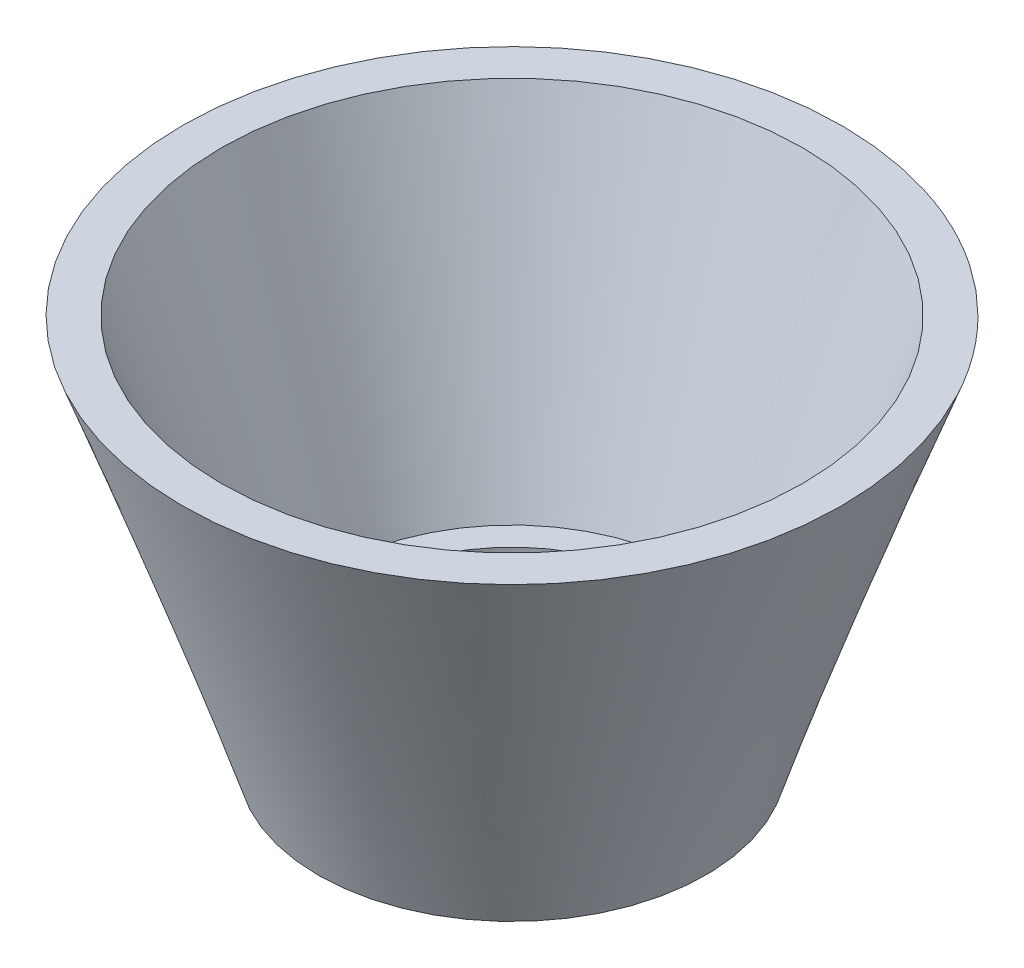
ISO-10303-21;
HEADER;
FILE_DESCRIPTION(('STEP AP214'),'2;1');
FILE_NAME('part.step','',(''),(''),'','','');
FILE_SCHEMA(('AUTOMOTIVE_DESIGN { 1 0 10303 214 1 1 1 1 }'));
ENDSEC;
DATA;
#1=APPLICATION_CONTEXT('core data for automotive mechanical design processes');
#2=APPLICATION_PROTOCOL_DEFINITION('international standard','automotive_design',2000,#1);
#3=PRODUCT_CONTEXT('',#1,'mechanical');
#4=PRODUCT('Part','Part','',(#3));
#5=PRODUCT_RELATED_PRODUCT_CATEGORY('part','',(#4));
#6=PRODUCT_DEFINITION_FORMATION('','',#4);
#7=PRODUCT_DEFINITION_CONTEXT('part definition',#1,'design');
#8=PRODUCT_DEFINITION('design','',#6,#7);
#9=PRODUCT_DEFINITION_SHAPE('','',#8);
#10=(LENGTH_UNIT() NAMED_UNIT(*) SI_UNIT(.MILLI.,.METRE.));
#11=(NAMED_UNIT(*) PLANE_ANGLE_UNIT() SI_UNIT($,.RADIAN.));
#12=(NAMED_UNIT(*) SI_UNIT($,.STERADIAN.) SOLID_ANGLE_UNIT());
#13=UNCERTAINTY_MEASURE_WITH_UNIT(LENGTH_MEASURE(1.E-05),#10,'distance_accuracy_value','');
#14=(GEOMETRIC_REPRESENTATION_CONTEXT(3) GLOBAL_UNCERTAINTY_ASSIGNED_CONTEXT((#13)) GLOBAL_UNIT_ASSIGNED_CONTEXT((#10,
#11,#12)) REPRESENTATION_CONTEXT('',''));
#15=CARTESIAN_POINT('',(0.,0.,0.));
#16=DIRECTION('',(0.,0.,1.));
#17=DIRECTION('',(1.,0.,0.));
#18=AXIS2_PLACEMENT_3D('',#15,#16,#17);
#19=CARTESIAN_POINT('',(0.,0.,0.));
#20=DIRECTION('',(0.,1.,0.));
#21=DIRECTION('',(0.,0.,1.));
#22=AXIS2_PLACEMENT_3D('',#19,#20,#21);
#23=CONICAL_SURFACE('',#22,4.,0.336674819386727);
#24=CARTESIAN_POINT('',(0.,10.,0.));
#25=DIRECTION('',(0.,-1.,0.));
#26=DIRECTION('',(0.,0.,-1.));
#27=AXIS2_PLACEMENT_3D('',#24,#25,#26);
#28=CIRCLE('',#27,7.5);
#29=CARTESIAN_POINT('',(0.,10.,-7.5));
#30=VERTEX_POINT('',#29);
#31=EDGE_CURVE('E51',#30,#30,#28,.T.);
#32=ORIENTED_EDGE('',*,*,#31,.F.);
#33=EDGE_LOOP('',(#32));
#34=FACE_BOUND('',#33,.T.);
#35=CARTESIAN_POINT('',(0.,2.,0.));
#36=DIRECTION('',(0.,-1.,0.));
#37=DIRECTION('',(0.,0.,-1.));
#38=AXIS2_PLACEMENT_3D('',#35,#36,#37);
#39=CIRCLE('',#38,4.7);
#40=CARTESIAN_POINT('',(0.,2.,-4.7));
#41=VERTEX_POINT('',#40);
#42=EDGE_CURVE('E11',#41,#41,#39,.F.);
#43=ORIENTED_EDGE('',*,*,#42,.F.);
#44=EDGE_LOOP('',(#43));
#45=FACE_BOUND('',#44,.T.);
#46=ADVANCED_FACE('F34',(#34,#45),#23,.F.);
#47=CARTESIAN_POINT('',(0.,0.,0.));
#48=DIRECTION('',(0.,1.,0.));
#49=DIRECTION('',(0.,0.,1.));
#50=AXIS2_PLACEMENT_3D('',#47,#48,#49);
#51=PLANE('',#50);
#52=CARTESIAN_POINT('',(0.,0.,0.));
#53=DIRECTION('',(0.,-1.,0.));
#54=DIRECTION('',(0.,0.,-1.));
#55=AXIS2_PLACEMENT_3D('',#52,#53,#54);
#56=CIRCLE('',#55,4.);
#57=CARTESIAN_POINT('',(0.,0.,-4.));
#58=VERTEX_POINT('',#57);
#59=EDGE_CURVE('E94',#58,#58,#56,.T.);
#60=ORIENTED_EDGE('',*,*,#59,.F.);
#61=EDGE_LOOP('',(#60));
#62=FACE_BOUND('',#61,.T.);
#63=CARTESIAN_POINT('',(0.,0.,0.));
#64=DIRECTION('',(0.,1.,0.));
#65=DIRECTION('',(0.,0.,1.));
#66=AXIS2_PLACEMENT_3D('',#63,#64,#65);
#67=CIRCLE('',#66,5.);
#68=CARTESIAN_POINT('',(-4.16170636920332,0.,2.77131739368347));
#69=VERTEX_POINT('',#68);
#70=EDGE_CURVE('E45',#69,#69,#67,.T.);
#71=ORIENTED_EDGE('',*,*,#70,.F.);
#72=EDGE_LOOP('',(#71));
#73=FACE_BOUND('',#72,.T.);
#74=ADVANCED_FACE('F36',(#62,#73),#51,.F.);
#75=CARTESIAN_POINT('',(0.,10.,0.));
#76=DIRECTION('',(0.,1.,0.));
#77=DIRECTION('',(0.,0.,1.));
#78=AXIS2_PLACEMENT_3D('',#75,#76,#77);
#79=PLANE('',#78);
#80=ORIENTED_EDGE('',*,*,#31,.T.);
#81=EDGE_LOOP('',(#80));
#82=FACE_BOUND('',#81,.T.);
#83=CARTESIAN_POINT('',(0.,10.,0.));
#84=DIRECTION('',(0.,1.,0.));
#85=DIRECTION('',(0.,0.,1.));
#86=AXIS2_PLACEMENT_3D('',#83,#84,#85);
#87=CIRCLE('',#86,8.5);
#88=CARTESIAN_POINT('',(-5.42221792896539,10.,6.54595697593608));
#89=VERTEX_POINT('',#88);
#90=EDGE_CURVE('E41',#89,#89,#87,.T.);
#91=ORIENTED_EDGE('',*,*,#90,.T.);
#92=EDGE_LOOP('',(#91));
#93=FACE_BOUND('',#92,.T.);
#94=ADVANCED_FACE('F59',(#82,#93),#79,.T.);
#95=CARTESIAN_POINT('',(-5.42221792896539,10.,6.54595697593608));
#96=CARTESIAN_POINT('',(-4.16170636920332,0.,2.77131739368347));
#97=CARTESIAN_POINT('',(-18.5141318808375,10.,-4.29847888199471));
#98=CARTESIAN_POINT('',(-9.70434115657025,0.,-5.55209534472317));
#99=CARTESIAN_POINT('',(-7.66969602290677,10.,-17.3903928338669));
#100=CARTESIAN_POINT('',(-1.38092841816361,0.,-11.0947301320901));
#101=CARTESIAN_POINT('',(5.42221792896539,10.,-6.54595697593608));
#102=CARTESIAN_POINT('',(4.16170636920332,0.,-2.77131739368347));
#103=CARTESIAN_POINT('',(18.5141318808375,10.,4.29847888199469));
#104=CARTESIAN_POINT('',(9.70434115657024,0.,5.55209534472317));
#105=CARTESIAN_POINT('',(7.66969602290677,10.,17.3903928338668));
#106=CARTESIAN_POINT('',(1.38092841816361,0.,11.0947301320901));
#107=CARTESIAN_POINT('',(-5.42221792896539,10.,6.54595697593608));
#108=CARTESIAN_POINT('',(-4.16170636920332,0.,2.77131739368347));
#109=(BOUNDED_SURFACE() B_SPLINE_SURFACE(3,1,((#95,#96),(#97,#98),(#99,#100),(#101,#102),(#103,
#104),(#105,#106),(#107,#108)),.UNSPECIFIED.,.T.,.F.,.F.) B_SPLINE_SURFACE_WITH_KNOTS((4,3,4),
(2,2),(0.,0.5,1.),(0.,1.),
.UNSPECIFIED.) GEOMETRIC_REPRESENTATION_ITEM() RATIONAL_B_SPLINE_SURFACE(((1.,1.),
(0.333333333333333,0.333333333333333),(0.333333333333333,0.333333333333333),(1.,1.),
(0.333333333333334,0.333333333333334),(0.333333333333334,0.333333333333334),(1.,1.))) REPRESENTATION_ITEM('') SURFACE());
#110=CARTESIAN_POINT('',(-5.42221792896539,10.,6.54595697593608));
#111=CARTESIAN_POINT('',(-5.40908760021787,9.89583333333333,6.50663781362095));
#112=CARTESIAN_POINT('',(-5.39595727147035,9.79166666666667,6.46731865130582));
#113=CARTESIAN_POINT('',(-5.36969661397531,9.58333333333333,6.38868032667555));
#114=CARTESIAN_POINT('',(-5.35656628522779,9.47916666666667,6.34936116436042));
#115=CARTESIAN_POINT('',(-5.33030562773274,9.27083333333333,6.27072283973016));
#116=CARTESIAN_POINT('',(-5.31717529898522,9.16666666666667,6.23140367741503));
#117=CARTESIAN_POINT('',(-5.29091464149018,8.95833333333333,6.15276535278477));
#118=CARTESIAN_POINT('',(-5.27778431274266,8.85416666666667,6.11344619046963));
#119=CARTESIAN_POINT('',(-5.25152365524761,8.64583333333333,6.03480786583937));
#120=CARTESIAN_POINT('',(-5.23839332650009,8.54166666666667,5.99548870352424));
#121=CARTESIAN_POINT('',(-5.21213266900505,8.33333333333333,5.91685037889398));
#122=CARTESIAN_POINT('',(-5.19900234025753,8.22916666666667,5.87753121657885));
#123=CARTESIAN_POINT('',(-5.17274168276248,8.02083333333333,5.79889289194858));
#124=CARTESIAN_POINT('',(-5.15961135401496,7.91666666666667,5.75957372963345));
#125=CARTESIAN_POINT('',(-5.13335069651992,7.70833333333333,5.68093540500319));
#126=CARTESIAN_POINT('',(-5.1202203677724,7.60416666666667,5.64161624268806));
#127=CARTESIAN_POINT('',(-5.09395971027736,7.39583333333333,5.5629779180578));
#128=CARTESIAN_POINT('',(-5.08082938152983,7.29166666666667,5.52365875574266));
#129=CARTESIAN_POINT('',(-5.05456872403479,7.08333333333333,5.4450204311124));
#130=CARTESIAN_POINT('',(-5.04143839528727,6.97916666666667,5.40570126879727));
#131=CARTESIAN_POINT('',(-5.01517773779223,6.77083333333333,5.32706294416701));
#132=CARTESIAN_POINT('',(-5.0020474090447,6.66666666666667,5.28774378185187));
#133=CARTESIAN_POINT('',(-4.97578675154966,6.45833333333333,5.20910545722161));
#134=CARTESIAN_POINT('',(-4.96265642280214,6.35416666666667,5.16978629490648));
#135=CARTESIAN_POINT('',(-4.9363957653071,6.14583333333333,5.09114797027622));
#136=CARTESIAN_POINT('',(-4.92326543655957,6.04166666666667,5.05182880796109));
#137=CARTESIAN_POINT('',(-4.89700477906453,5.83333333333333,4.97319048333082));
#138=CARTESIAN_POINT('',(-4.88387445031701,5.72916666666667,4.93387132101569));
#139=CARTESIAN_POINT('',(-4.85761379282197,5.52083333333333,4.85523299638543));
#140=CARTESIAN_POINT('',(-4.84448346407444,5.41666666666667,4.8159138340703));
#141=CARTESIAN_POINT('',(-4.8182228065794,5.20833333333333,4.73727550944004));
#142=CARTESIAN_POINT('',(-4.80509247783188,5.10416666666667,4.6979563471249));
#143=CARTESIAN_POINT('',(-4.77883182033684,4.89583333333333,4.61931802249464));
#144=CARTESIAN_POINT('',(-4.76570149158931,4.79166666666667,4.57999886017951));
#145=CARTESIAN_POINT('',(-4.73944083409427,4.58333333333333,4.50136053554925));
#146=CARTESIAN_POINT('',(-4.72631050534675,4.47916666666667,4.46204137323412));
#147=CARTESIAN_POINT('',(-4.70004984785171,4.27083333333333,4.38340304860385));
#148=CARTESIAN_POINT('',(-4.68691951910419,4.16666666666667,4.34408388628872));
#149=CARTESIAN_POINT('',(-4.66065886160914,3.95833333333333,4.26544556165846));
#150=CARTESIAN_POINT('',(-4.64752853286162,3.85416666666667,4.22612639934333));
#151=CARTESIAN_POINT('',(-4.62126787536658,3.64583333333333,4.14748807471307));
#152=CARTESIAN_POINT('',(-4.60813754661906,3.54166666666667,4.10816891239793));
#153=CARTESIAN_POINT('',(-4.58187688912401,3.33333333333333,4.02953058776767));
#154=CARTESIAN_POINT('',(-4.56874656037649,3.22916666666667,3.99021142545254));
#155=CARTESIAN_POINT('',(-4.54248590288145,3.02083333333333,3.91157310082228));
#156=CARTESIAN_POINT('',(-4.52935557413393,2.91666666666667,3.87225393850714));
#157=CARTESIAN_POINT('',(-4.50309491663888,2.70833333333333,3.79361561387688));
#158=CARTESIAN_POINT('',(-4.48996458789136,2.60416666666667,3.75429645156175));
#159=CARTESIAN_POINT('',(-4.46370393039632,2.39583333333333,3.67565812693149));
#160=CARTESIAN_POINT('',(-4.4505736016488,2.29166666666667,3.63633896461636));
#161=CARTESIAN_POINT('',(-4.42431294415375,2.08333333333333,3.55770063998609));
#162=CARTESIAN_POINT('',(-4.41118261540623,1.97916666666667,3.51838147767096));
#163=CARTESIAN_POINT('',(-4.38492195791119,1.77083333333333,3.4397431530407));
#164=CARTESIAN_POINT('',(-4.37179162916367,1.66666666666667,3.40042399072557));
#165=CARTESIAN_POINT('',(-4.34553097166862,1.45833333333333,3.3217856660953));
#166=CARTESIAN_POINT('',(-4.3324006429211,1.35416666666667,3.28246650378017));
#167=CARTESIAN_POINT('',(-4.30613998542606,1.14583333333333,3.20382817914991));
#168=CARTESIAN_POINT('',(-4.29300965667854,1.04166666666667,3.16450901683478));
#169=CARTESIAN_POINT('',(-4.26674899918349,0.833333333333333,3.08587069220452));
#170=CARTESIAN_POINT('',(-4.25361867043597,0.729166666666667,3.04655152988939));
#171=CARTESIAN_POINT('',(-4.22735801294093,0.520833333333333,2.96791320525912));
#172=CARTESIAN_POINT('',(-4.21422768419341,0.416666666666667,2.92859404294399));
#173=CARTESIAN_POINT('',(-4.18796702669836,0.208333333333333,2.84995571831373));
#174=CARTESIAN_POINT('',(-4.17483669795084,0.104166666666667,2.8106365559986));
#175=CARTESIAN_POINT('',(-4.16170636920332,0.,2.77131739368347));
#176=B_SPLINE_CURVE_WITH_KNOTS('',3,(#110,#111,#112,#113,#114,#115,#116,#117,#118,#119,#120,
#121,#122,#123,#124,#125,#126,#127,#128,#129,#130,#131,#132,#133,#134,#135,#136,#137,#138,#139,
#140,#141,#142,#143,#144,#145,#146,#147,#148,#149,#150,#151,#152,#153,#154,#155,#156,#157,#158,
#159,#160,#161,#162,#163,#164,#165,#166,#167,#168,#169,#170,#171,#172,#173,#174,#175),
.UNSPECIFIED.,.F.,.F.,(4,2,2,2,2,2,2,2,2,2,2,2,2,2,2,2,2,2,2,2,2,2,2,2,2,2,2,2,2,2,2,2,4),(0.,
0.336335945928524,0.672671891857048,1.00900783778557,1.34534378371409,1.68167972964262,
2.01801567557114,2.35435162149967,2.69068756742819,3.02702351335671,3.36335945928524,
3.69969540521376,4.03603135114228,4.37236729707081,4.70870324299933,5.04503918892785,
5.38137513485638,5.7177110807849,6.05404702671343,6.39038297264195,6.72671891857047,
7.063054864499,7.39939081042752,7.73572675635605,8.07206270228457,8.40839864821309,
8.74473459414162,9.08107054007014,9.41740648599866,9.75374243192718,10.0900783778557,
10.4264143237842,10.7627502697128),.UNSPECIFIED.);
#177=EDGE_CURVE('BSEAM68',#89,#69,#176,.T.);
#178=ORIENTED_EDGE('',*,*,#90,.F.);
#179=ORIENTED_EDGE('',*,*,#70,.T.);
#180=ORIENTED_EDGE('',*,*,#177,.T.);
#181=ORIENTED_EDGE('',*,*,#177,.F.);
#182=EDGE_LOOP('',(#178,#180,#179,#181));
#183=FACE_BOUND('',#182,.T.);
#184=ADVANCED_FACE('F68',(#183),#109,.T.);
#185=CARTESIAN_POINT('',(0.,2.,0.));
#186=DIRECTION('',(0.,-1.,0.));
#187=DIRECTION('',(0.,0.,-1.));
#188=AXIS2_PLACEMENT_3D('',#185,#186,#187);
#189=PLANE('',#188);
#190=CARTESIAN_POINT('',(0.,2.,0.));
#191=DIRECTION('',(0.,-1.,0.));
#192=DIRECTION('',(0.,0.,-1.));
#193=AXIS2_PLACEMENT_3D('',#190,#191,#192);
#194=CIRCLE('',#193,4.);
#195=CARTESIAN_POINT('',(0.,2.,-4.));
#196=VERTEX_POINT('',#195);
#197=EDGE_CURVE('E93',#196,#196,#194,.T.);
#198=ORIENTED_EDGE('',*,*,#197,.T.);
#199=EDGE_LOOP('',(#198));
#200=FACE_BOUND('',#199,.T.);
#201=ORIENTED_EDGE('',*,*,#42,.T.);
#202=EDGE_LOOP('',(#201));
#203=FACE_BOUND('',#202,.T.);
#204=ADVANCED_FACE('F75',(#200,#203),#189,.F.);
#205=CARTESIAN_POINT('',(0.,2.,0.));
#206=DIRECTION('',(0.,-1.,0.));
#207=DIRECTION('',(0.,0.,-1.));
#208=AXIS2_PLACEMENT_3D('',#205,#206,#207);
#209=CYLINDRICAL_SURFACE('',#208,4.);
#210=ORIENTED_EDGE('',*,*,#197,.F.);
#211=EDGE_LOOP('',(#210));
#212=FACE_BOUND('',#211,.T.);
#213=ORIENTED_EDGE('',*,*,#59,.T.);
#214=EDGE_LOOP('',(#213));
#215=FACE_BOUND('',#214,.T.);
#216=ADVANCED_FACE('F101',(#212,#215),#209,.F.);
#217=CLOSED_SHELL('',(#46,#74,#94,#184,#204,#216));
#218=MANIFOLD_SOLID_BREP('B2',#217);
#219=ADVANCED_BREP_SHAPE_REPRESENTATION('',(#18,#218),#14);
#220=SHAPE_DEFINITION_REPRESENTATION(#9,#219);
ENDSEC;
END-ISO-10303-21;
